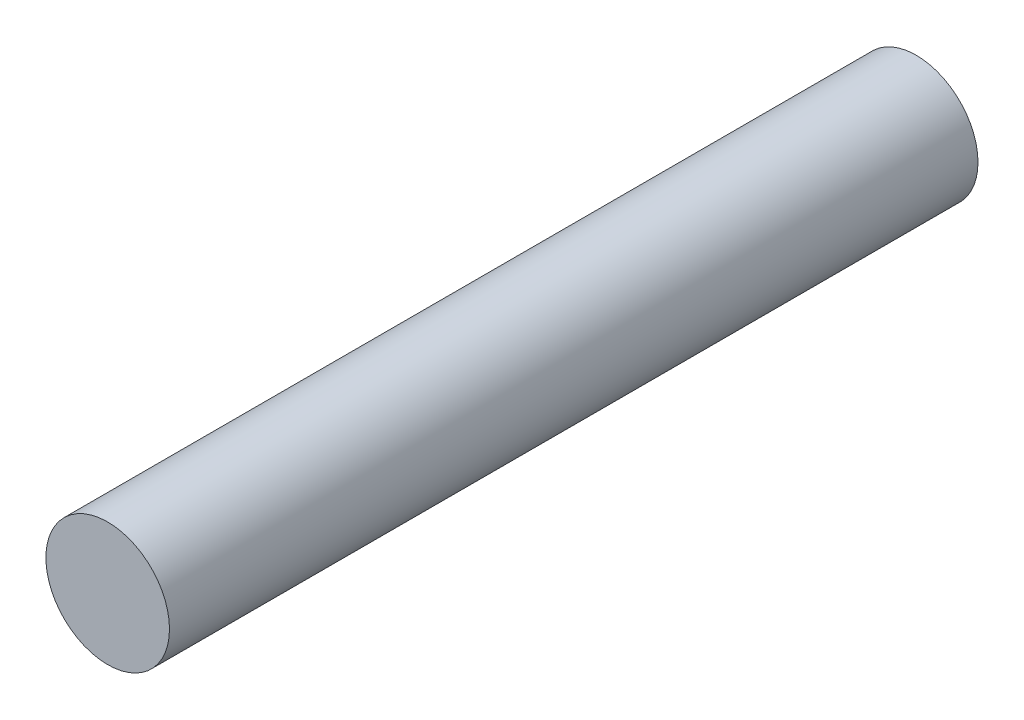
ISO-10303-21;
HEADER;
FILE_DESCRIPTION(('STEP AP214'),'2;1');
FILE_NAME('part.step','',(''),(''),'','','');
FILE_SCHEMA(('AUTOMOTIVE_DESIGN { 1 0 10303 214 1 1 1 1 }'));
ENDSEC;
DATA;
#1=APPLICATION_CONTEXT('core data for automotive mechanical design processes');
#2=APPLICATION_PROTOCOL_DEFINITION('international standard','automotive_design',2000,#1);
#3=PRODUCT_CONTEXT('',#1,'mechanical');
#4=PRODUCT('Part','Part','',(#3));
#5=PRODUCT_RELATED_PRODUCT_CATEGORY('part','',(#4));
#6=PRODUCT_DEFINITION_FORMATION('','',#4);
#7=PRODUCT_DEFINITION_CONTEXT('part definition',#1,'design');
#8=PRODUCT_DEFINITION('design','',#6,#7);
#9=PRODUCT_DEFINITION_SHAPE('','',#8);
#10=(LENGTH_UNIT() NAMED_UNIT(*) SI_UNIT(.MILLI.,.METRE.));
#11=(NAMED_UNIT(*) PLANE_ANGLE_UNIT() SI_UNIT($,.RADIAN.));
#12=(NAMED_UNIT(*) SI_UNIT($,.STERADIAN.) SOLID_ANGLE_UNIT());
#13=UNCERTAINTY_MEASURE_WITH_UNIT(LENGTH_MEASURE(1.E-05),#10,'distance_accuracy_value','');
#14=(GEOMETRIC_REPRESENTATION_CONTEXT(3) GLOBAL_UNCERTAINTY_ASSIGNED_CONTEXT((#13)) GLOBAL_UNIT_ASSIGNED_CONTEXT((#10,
#11,#12)) REPRESENTATION_CONTEXT('',''));
#15=CARTESIAN_POINT('',(0.,0.,0.));
#16=DIRECTION('',(0.,0.,1.));
#17=DIRECTION('',(1.,0.,0.));
#18=AXIS2_PLACEMENT_3D('',#15,#16,#17);
#19=CARTESIAN_POINT('',(0.,0.,78.5));
#20=DIRECTION('',(0.,0.,-1.));
#21=DIRECTION('',(-1.,0.,0.));
#22=AXIS2_PLACEMENT_3D('',#19,#20,#21);
#23=CYLINDRICAL_SURFACE('',#22,6.);
#24=CARTESIAN_POINT('',(0.,0.,78.5));
#25=DIRECTION('',(0.,0.,1.));
#26=DIRECTION('',(1.,0.,0.));
#27=AXIS2_PLACEMENT_3D('',#24,#25,#26);
#28=CIRCLE('',#27,6.);
#29=CARTESIAN_POINT('',(6.,0.,78.5));
#30=VERTEX_POINT('',#29);
#31=EDGE_CURVE('E10',#30,#30,#28,.T.);
#32=ORIENTED_EDGE('',*,*,#31,.F.);
#33=EDGE_LOOP('',(#32));
#34=FACE_BOUND('',#33,.T.);
#35=CARTESIAN_POINT('',(0.,0.,0.));
#36=DIRECTION('',(0.,0.,1.));
#37=DIRECTION('',(1.,0.,0.));
#38=AXIS2_PLACEMENT_3D('',#35,#36,#37);
#39=CIRCLE('',#38,6.);
#40=CARTESIAN_POINT('',(6.,0.,0.));
#41=VERTEX_POINT('',#40);
#42=EDGE_CURVE('E36',#41,#41,#39,.T.);
#43=ORIENTED_EDGE('',*,*,#42,.T.);
#44=EDGE_LOOP('',(#43));
#45=FACE_BOUND('',#44,.T.);
#46=ADVANCED_FACE('F33',(#34,#45),#23,.T.);
#47=CARTESIAN_POINT('',(0.,0.,78.5));
#48=DIRECTION('',(0.,0.,1.));
#49=DIRECTION('',(1.,0.,0.));
#50=AXIS2_PLACEMENT_3D('',#47,#48,#49);
#51=PLANE('',#50);
#52=ORIENTED_EDGE('',*,*,#31,.T.);
#53=EDGE_LOOP('',(#52));
#54=FACE_BOUND('',#53,.T.);
#55=ADVANCED_FACE('F62',(#54),#51,.T.);
#56=CARTESIAN_POINT('',(0.,0.,0.));
#57=DIRECTION('',(0.,0.,1.));
#58=DIRECTION('',(1.,0.,0.));
#59=AXIS2_PLACEMENT_3D('',#56,#57,#58);
#60=PLANE('',#59);
#61=CARTESIAN_POINT('',(0.,0.,0.));
#62=DIRECTION('',(0.,0.,-1.));
#63=DIRECTION('',(-1.,0.,0.));
#64=AXIS2_PLACEMENT_3D('',#61,#62,#63);
#65=CIRCLE('',#64,4.5);
#66=CARTESIAN_POINT('',(-4.5,0.,0.));
#67=VERTEX_POINT('',#66);
#68=EDGE_CURVE('E45',#67,#67,#65,.T.);
#69=ORIENTED_EDGE('',*,*,#68,.F.);
#70=EDGE_LOOP('',(#69));
#71=FACE_BOUND('',#70,.T.);
#72=ORIENTED_EDGE('',*,*,#42,.F.);
#73=EDGE_LOOP('',(#72));
#74=FACE_BOUND('',#73,.T.);
#75=ADVANCED_FACE('F56',(#71,#74),#60,.F.);
#76=CARTESIAN_POINT('',(0.,0.,2.4));
#77=DIRECTION('',(0.,0.,-1.));
#78=DIRECTION('',(-1.,0.,0.));
#79=AXIS2_PLACEMENT_3D('',#76,#77,#78);
#80=CYLINDRICAL_SURFACE('',#79,4.5);
#81=CARTESIAN_POINT('',(0.,0.,2.4));
#82=DIRECTION('',(0.,0.,-1.));
#83=DIRECTION('',(-1.,0.,0.));
#84=AXIS2_PLACEMENT_3D('',#81,#82,#83);
#85=CIRCLE('',#84,4.5);
#86=CARTESIAN_POINT('',(-4.5,0.,2.4));
#87=VERTEX_POINT('',#86);
#88=EDGE_CURVE('E43',#87,#87,#85,.T.);
#89=ORIENTED_EDGE('',*,*,#88,.F.);
#90=EDGE_LOOP('',(#89));
#91=FACE_BOUND('',#90,.T.);
#92=ORIENTED_EDGE('',*,*,#68,.T.);
#93=EDGE_LOOP('',(#92));
#94=FACE_BOUND('',#93,.T.);
#95=ADVANCED_FACE('F53',(#91,#94),#80,.F.);
#96=CARTESIAN_POINT('',(0.,0.,2.4));
#97=DIRECTION('',(0.,0.,-1.));
#98=DIRECTION('',(-1.,0.,0.));
#99=AXIS2_PLACEMENT_3D('',#96,#97,#98);
#100=PLANE('',#99);
#101=ORIENTED_EDGE('',*,*,#88,.T.);
#102=EDGE_LOOP('',(#101));
#103=FACE_BOUND('',#102,.T.);
#104=ADVANCED_FACE('F51',(#103),#100,.T.);
#105=CLOSED_SHELL('',(#46,#55,#75,#95,#104));
#106=MANIFOLD_SOLID_BREP('B2',#105);
#107=ADVANCED_BREP_SHAPE_REPRESENTATION('',(#18,#106),#14);
#108=SHAPE_DEFINITION_REPRESENTATION(#9,#107);
ENDSEC;
END-ISO-10303-21;
